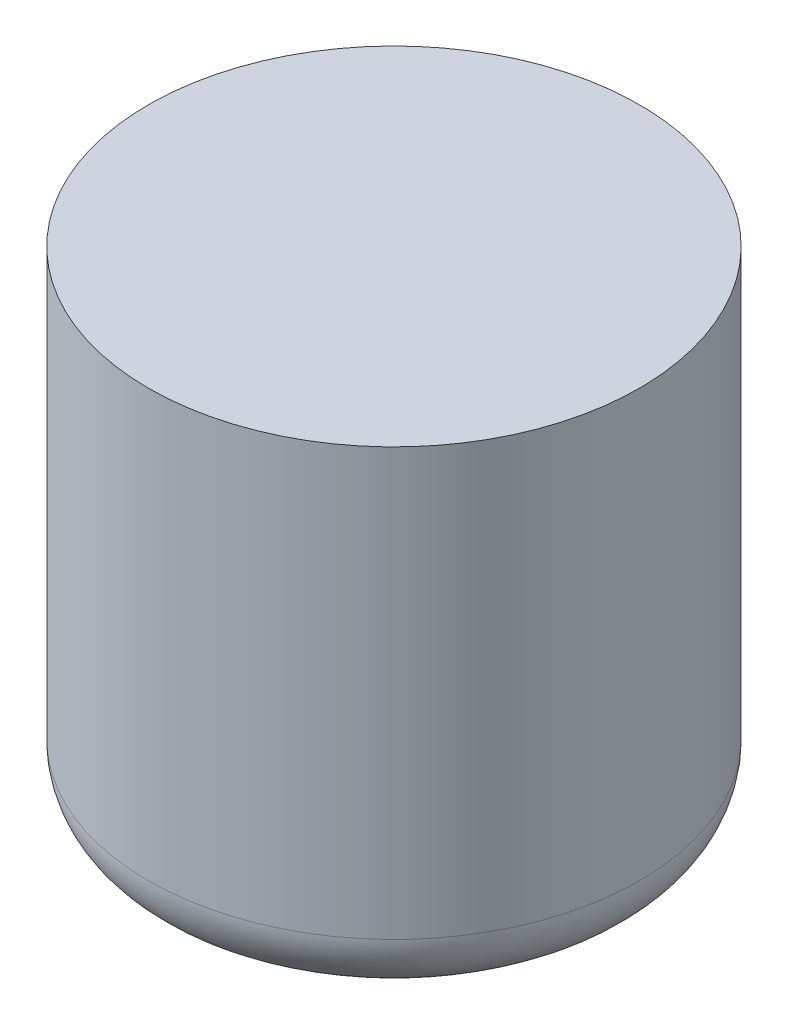
ISO-10303-21;
HEADER;
FILE_DESCRIPTION(('STEP AP214'),'2;1');
FILE_NAME('part.step','',(''),(''),'','','');
FILE_SCHEMA(('AUTOMOTIVE_DESIGN { 1 0 10303 214 1 1 1 1 }'));
ENDSEC;
DATA;
#1=APPLICATION_CONTEXT('core data for automotive mechanical design processes');
#2=APPLICATION_PROTOCOL_DEFINITION('international standard','automotive_design',2000,#1);
#3=PRODUCT_CONTEXT('',#1,'mechanical');
#4=PRODUCT('Part','Part','',(#3));
#5=PRODUCT_RELATED_PRODUCT_CATEGORY('part','',(#4));
#6=PRODUCT_DEFINITION_FORMATION('','',#4);
#7=PRODUCT_DEFINITION_CONTEXT('part definition',#1,'design');
#8=PRODUCT_DEFINITION('design','',#6,#7);
#9=PRODUCT_DEFINITION_SHAPE('','',#8);
#10=(LENGTH_UNIT() NAMED_UNIT(*) SI_UNIT(.MILLI.,.METRE.));
#11=(NAMED_UNIT(*) PLANE_ANGLE_UNIT() SI_UNIT($,.RADIAN.));
#12=(NAMED_UNIT(*) SI_UNIT($,.STERADIAN.) SOLID_ANGLE_UNIT());
#13=UNCERTAINTY_MEASURE_WITH_UNIT(LENGTH_MEASURE(1.E-05),#10,'distance_accuracy_value','');
#14=(GEOMETRIC_REPRESENTATION_CONTEXT(3) GLOBAL_UNCERTAINTY_ASSIGNED_CONTEXT((#13)) GLOBAL_UNIT_ASSIGNED_CONTEXT((#10,
#11,#12)) REPRESENTATION_CONTEXT('',''));
#15=CARTESIAN_POINT('',(0.,0.,0.));
#16=DIRECTION('',(0.,0.,1.));
#17=DIRECTION('',(1.,0.,0.));
#18=AXIS2_PLACEMENT_3D('',#15,#16,#17);
#19=CARTESIAN_POINT('',(0.,38.1,0.));
#20=DIRECTION('',(0.,-1.,0.));
#21=DIRECTION('',(0.,0.,-1.));
#22=AXIS2_PLACEMENT_3D('',#19,#20,#21);
#23=CYLINDRICAL_SURFACE('',#22,19.05);
#24=CARTESIAN_POINT('',(0.,4.99999999999999,0.));
#25=DIRECTION('',(0.,1.,0.));
#26=DIRECTION('',(0.,0.,1.));
#27=AXIS2_PLACEMENT_3D('',#24,#25,#26);
#28=CIRCLE('',#27,19.05);
#29=CARTESIAN_POINT('',(0.,4.99999999999999,19.05));
#30=VERTEX_POINT('',#29);
#31=EDGE_CURVE('E51',#30,#30,#28,.T.);
#32=ORIENTED_EDGE('',*,*,#31,.T.);
#33=EDGE_LOOP('',(#32));
#34=FACE_BOUND('',#33,.T.);
#35=CARTESIAN_POINT('',(0.,38.1,0.));
#36=DIRECTION('',(0.,1.,0.));
#37=DIRECTION('',(0.,0.,1.));
#38=AXIS2_PLACEMENT_3D('',#35,#36,#37);
#39=CIRCLE('',#38,19.05);
#40=CARTESIAN_POINT('',(0.,38.1,19.05));
#41=VERTEX_POINT('',#40);
#42=EDGE_CURVE('E56',#41,#41,#39,.T.);
#43=ORIENTED_EDGE('',*,*,#42,.F.);
#44=EDGE_LOOP('',(#43));
#45=FACE_BOUND('',#44,.T.);
#46=ADVANCED_FACE('F43',(#34,#45),#23,.T.);
#47=CARTESIAN_POINT('',(0.,38.1,0.));
#48=DIRECTION('',(0.,1.,0.));
#49=DIRECTION('',(0.,0.,1.));
#50=AXIS2_PLACEMENT_3D('',#47,#48,#49);
#51=PLANE('',#50);
#52=ORIENTED_EDGE('',*,*,#42,.T.);
#53=EDGE_LOOP('',(#52));
#54=FACE_BOUND('',#53,.T.);
#55=ADVANCED_FACE('F64',(#54),#51,.T.);
#56=CARTESIAN_POINT('',(0.,0.,0.));
#57=DIRECTION('',(0.,1.,0.));
#58=DIRECTION('',(0.,0.,1.));
#59=AXIS2_PLACEMENT_3D('',#56,#57,#58);
#60=PLANE('',#59);
#61=CARTESIAN_POINT('',(0.,0.,0.));
#62=DIRECTION('',(0.,1.,0.));
#63=DIRECTION('',(0.,0.,1.));
#64=AXIS2_PLACEMENT_3D('',#61,#62,#63);
#65=CIRCLE('',#64,14.05);
#66=CARTESIAN_POINT('',(0.,0.,14.05));
#67=VERTEX_POINT('',#66);
#68=EDGE_CURVE('E11',#67,#67,#65,.F.);
#69=ORIENTED_EDGE('',*,*,#68,.T.);
#70=EDGE_LOOP('',(#69));
#71=FACE_BOUND('',#70,.T.);
#72=ADVANCED_FACE('F72',(#71),#60,.F.);
#73=CARTESIAN_POINT('',(0.,5.,0.));
#74=DIRECTION('',(0.,1.,0.));
#75=DIRECTION('',(0.,0.,1.));
#76=AXIS2_PLACEMENT_3D('',#73,#74,#75);
#77=TOROIDAL_SURFACE('',#76,14.05,5.);
#78=ORIENTED_EDGE('',*,*,#68,.F.);
#79=EDGE_LOOP('',(#78));
#80=FACE_BOUND('',#79,.T.);
#81=ORIENTED_EDGE('',*,*,#31,.F.);
#82=EDGE_LOOP('',(#81));
#83=FACE_BOUND('',#82,.T.);
#84=ADVANCED_FACE('F45',(#80,#83),#77,.T.);
#85=CLOSED_SHELL('',(#46,#55,#72,#84));
#86=MANIFOLD_SOLID_BREP('B2',#85);
#87=ADVANCED_BREP_SHAPE_REPRESENTATION('',(#18,#86),#14);
#88=SHAPE_DEFINITION_REPRESENTATION(#9,#87);
ENDSEC;
END-ISO-10303-21;
